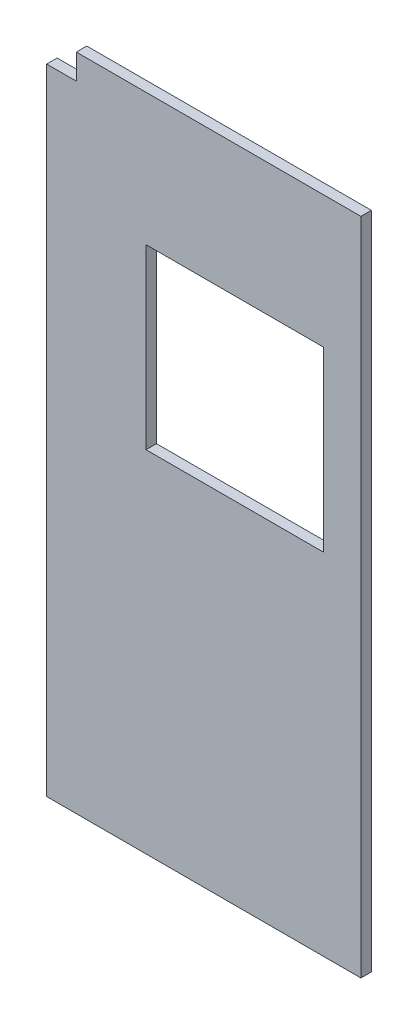
ISO-10303-21;
HEADER;
FILE_DESCRIPTION(('STEP AP214'),'2;1');
FILE_NAME('part.step','',(''),(''),'','','');
FILE_SCHEMA(('AUTOMOTIVE_DESIGN { 1 0 10303 214 1 1 1 1 }'));
ENDSEC;
DATA;
#1=APPLICATION_CONTEXT('core data for automotive mechanical design processes');
#2=APPLICATION_PROTOCOL_DEFINITION('international standard','automotive_design',2000,#1);
#3=PRODUCT_CONTEXT('',#1,'mechanical');
#4=PRODUCT('Part','Part','',(#3));
#5=PRODUCT_RELATED_PRODUCT_CATEGORY('part','',(#4));
#6=PRODUCT_DEFINITION_FORMATION('','',#4);
#7=PRODUCT_DEFINITION_CONTEXT('part definition',#1,'design');
#8=PRODUCT_DEFINITION('design','',#6,#7);
#9=PRODUCT_DEFINITION_SHAPE('','',#8);
#10=(LENGTH_UNIT() NAMED_UNIT(*) SI_UNIT(.MILLI.,.METRE.));
#11=(NAMED_UNIT(*) PLANE_ANGLE_UNIT() SI_UNIT($,.RADIAN.));
#12=(NAMED_UNIT(*) SI_UNIT($,.STERADIAN.) SOLID_ANGLE_UNIT());
#13=UNCERTAINTY_MEASURE_WITH_UNIT(LENGTH_MEASURE(1.E-05),#10,'distance_accuracy_value','');
#14=(GEOMETRIC_REPRESENTATION_CONTEXT(3) GLOBAL_UNCERTAINTY_ASSIGNED_CONTEXT((#13)) GLOBAL_UNIT_ASSIGNED_CONTEXT((#10,
#11,#12)) REPRESENTATION_CONTEXT('',''));
#15=CARTESIAN_POINT('',(0.,0.,0.));
#16=DIRECTION('',(0.,0.,1.));
#17=DIRECTION('',(1.,0.,0.));
#18=AXIS2_PLACEMENT_3D('',#15,#16,#17);
#19=CARTESIAN_POINT('',(0.,0.,38.1));
#20=DIRECTION('',(0.,0.,1.));
#21=DIRECTION('',(1.,0.,0.));
#22=AXIS2_PLACEMENT_3D('',#19,#20,#21);
#23=PLANE('',#22);
#24=DIRECTION('',(0.,1.,0.));
#25=VECTOR('',#24,1.);
#26=CARTESIAN_POINT('',(-464.947,1202.944,38.1));
#27=LINE('',#26,#25);
#28=CARTESIAN_POINT('',(-464.947,1110.996,38.1));
#29=VERTEX_POINT('',#28);
#30=CARTESIAN_POINT('',(-464.947,1202.944,38.1));
#31=VERTEX_POINT('',#30);
#32=EDGE_CURVE('E110',#29,#31,#27,.T.);
#33=ORIENTED_EDGE('',*,*,#32,.F.);
#34=DIRECTION('',(1.,0.,0.));
#35=VECTOR('',#34,1.);
#36=CARTESIAN_POINT('',(-573.151,1110.996,38.1));
#37=LINE('',#36,#35);
#38=CARTESIAN_POINT('',(-573.151,1110.996,38.1));
#39=VERTEX_POINT('',#38);
#40=EDGE_CURVE('E120',#39,#29,#37,.T.);
#41=ORIENTED_EDGE('',*,*,#40,.F.);
#42=DIRECTION('',(0.,-1.,0.));
#43=VECTOR('',#42,1.);
#44=CARTESIAN_POINT('',(-573.151,1202.944,38.1));
#45=LINE('',#44,#43);
#46=CARTESIAN_POINT('',(-573.151,-1202.944,38.1));
#47=VERTEX_POINT('',#46);
#48=EDGE_CURVE('E134',#39,#47,#45,.T.);
#49=ORIENTED_EDGE('',*,*,#48,.T.);
#50=DIRECTION('',(1.,0.,0.));
#51=VECTOR('',#50,1.);
#52=CARTESIAN_POINT('',(-573.151,-1202.944,38.1));
#53=LINE('',#52,#51);
#54=CARTESIAN_POINT('',(573.151,-1202.944,38.1));
#55=VERTEX_POINT('',#54);
#56=EDGE_CURVE('E136',#47,#55,#53,.T.);
#57=ORIENTED_EDGE('',*,*,#56,.T.);
#58=DIRECTION('',(0.,1.,0.));
#59=VECTOR('',#58,1.);
#60=CARTESIAN_POINT('',(573.151,1202.944,38.1));
#61=LINE('',#60,#59);
#62=CARTESIAN_POINT('',(573.151,1202.944,38.1));
#63=VERTEX_POINT('',#62);
#64=EDGE_CURVE('E132',#55,#63,#61,.T.);
#65=ORIENTED_EDGE('',*,*,#64,.T.);
#66=DIRECTION('',(-1.,0.,0.));
#67=VECTOR('',#66,1.);
#68=CARTESIAN_POINT('',(-573.151,1202.944,38.1));
#69=LINE('',#68,#67);
#70=EDGE_CURVE('E125',#63,#31,#69,.T.);
#71=ORIENTED_EDGE('',*,*,#70,.T.);
#72=EDGE_LOOP('',(#33,#41,#49,#57,#65,#71));
#73=FACE_BOUND('',#72,.T.);
#74=DIRECTION('',(-1.,0.,0.));
#75=VECTOR('',#74,1.);
#76=CARTESIAN_POINT('',(-210.693,721.614,38.1));
#77=LINE('',#76,#75);
#78=CARTESIAN_POINT('',(437.007,721.614,38.1));
#79=VERTEX_POINT('',#78);
#80=CARTESIAN_POINT('',(-210.693,721.614,38.1));
#81=VERTEX_POINT('',#80);
#82=EDGE_CURVE('E195',#79,#81,#77,.T.);
#83=ORIENTED_EDGE('',*,*,#82,.F.);
#84=DIRECTION('',(0.,1.,0.));
#85=VECTOR('',#84,1.);
#86=CARTESIAN_POINT('',(437.007,721.614,38.1));
#87=LINE('',#86,#85);
#88=CARTESIAN_POINT('',(437.007,73.914,38.1));
#89=VERTEX_POINT('',#88);
#90=EDGE_CURVE('E193',#89,#79,#87,.T.);
#91=ORIENTED_EDGE('',*,*,#90,.F.);
#92=DIRECTION('',(1.,0.,0.));
#93=VECTOR('',#92,1.);
#94=CARTESIAN_POINT('',(-210.693,73.914,38.1));
#95=LINE('',#94,#93);
#96=CARTESIAN_POINT('',(-210.693,73.914,38.1));
#97=VERTEX_POINT('',#96);
#98=EDGE_CURVE('E200',#97,#89,#95,.T.);
#99=ORIENTED_EDGE('',*,*,#98,.F.);
#100=DIRECTION('',(0.,-1.,0.));
#101=VECTOR('',#100,1.);
#102=CARTESIAN_POINT('',(-210.693,721.614,38.1));
#103=LINE('',#102,#101);
#104=EDGE_CURVE('E198',#81,#97,#103,.T.);
#105=ORIENTED_EDGE('',*,*,#104,.F.);
#106=EDGE_LOOP('',(#83,#91,#99,#105));
#107=FACE_BOUND('',#106,.T.);
#108=ADVANCED_FACE('F33',(#73,#107),#23,.T.);
#109=CARTESIAN_POINT('',(0.,0.,0.));
#110=DIRECTION('',(0.,0.,1.));
#111=DIRECTION('',(1.,0.,0.));
#112=AXIS2_PLACEMENT_3D('',#109,#110,#111);
#113=PLANE('',#112);
#114=DIRECTION('',(-1.,0.,0.));
#115=VECTOR('',#114,1.);
#116=CARTESIAN_POINT('',(-573.151,1110.996,0.));
#117=LINE('',#116,#115);
#118=CARTESIAN_POINT('',(-464.947,1110.996,0.));
#119=VERTEX_POINT('',#118);
#120=CARTESIAN_POINT('',(-573.151,1110.996,0.));
#121=VERTEX_POINT('',#120);
#122=EDGE_CURVE('E48',#119,#121,#117,.T.);
#123=ORIENTED_EDGE('',*,*,#122,.F.);
#124=DIRECTION('',(0.,-1.,0.));
#125=VECTOR('',#124,1.);
#126=CARTESIAN_POINT('',(-464.947,1202.944,0.));
#127=LINE('',#126,#125);
#128=CARTESIAN_POINT('',(-464.947,1202.944,0.));
#129=VERTEX_POINT('',#128);
#130=EDGE_CURVE('E207',#129,#119,#127,.T.);
#131=ORIENTED_EDGE('',*,*,#130,.F.);
#132=DIRECTION('',(-1.,0.,0.));
#133=VECTOR('',#132,1.);
#134=CARTESIAN_POINT('',(-573.151,1202.944,0.));
#135=LINE('',#134,#133);
#136=CARTESIAN_POINT('',(573.151,1202.944,0.));
#137=VERTEX_POINT('',#136);
#138=EDGE_CURVE('E127',#137,#129,#135,.T.);
#139=ORIENTED_EDGE('',*,*,#138,.F.);
#140=DIRECTION('',(0.,1.,0.));
#141=VECTOR('',#140,1.);
#142=CARTESIAN_POINT('',(573.151,1202.944,0.));
#143=LINE('',#142,#141);
#144=CARTESIAN_POINT('',(573.151,-1202.944,0.));
#145=VERTEX_POINT('',#144);
#146=EDGE_CURVE('E144',#145,#137,#143,.T.);
#147=ORIENTED_EDGE('',*,*,#146,.F.);
#148=DIRECTION('',(1.,0.,0.));
#149=VECTOR('',#148,1.);
#150=CARTESIAN_POINT('',(-573.151,-1202.944,0.));
#151=LINE('',#150,#149);
#152=CARTESIAN_POINT('',(-573.151,-1202.944,0.));
#153=VERTEX_POINT('',#152);
#154=EDGE_CURVE('E138',#153,#145,#151,.T.);
#155=ORIENTED_EDGE('',*,*,#154,.F.);
#156=DIRECTION('',(0.,-1.,0.));
#157=VECTOR('',#156,1.);
#158=CARTESIAN_POINT('',(-573.151,1202.944,0.));
#159=LINE('',#158,#157);
#160=EDGE_CURVE('E149',#121,#153,#159,.T.);
#161=ORIENTED_EDGE('',*,*,#160,.F.);
#162=EDGE_LOOP('',(#123,#131,#139,#147,#155,#161));
#163=FACE_BOUND('',#162,.T.);
#164=DIRECTION('',(0.,1.,0.));
#165=VECTOR('',#164,1.);
#166=CARTESIAN_POINT('',(437.007,721.614,0.));
#167=LINE('',#166,#165);
#168=CARTESIAN_POINT('',(437.007,73.914,0.));
#169=VERTEX_POINT('',#168);
#170=CARTESIAN_POINT('',(437.007,721.614,0.));
#171=VERTEX_POINT('',#170);
#172=EDGE_CURVE('E203',#169,#171,#167,.T.);
#173=ORIENTED_EDGE('',*,*,#172,.T.);
#174=DIRECTION('',(-1.,0.,0.));
#175=VECTOR('',#174,1.);
#176=CARTESIAN_POINT('',(-210.693,721.614,0.));
#177=LINE('',#176,#175);
#178=CARTESIAN_POINT('',(-210.693,721.614,0.));
#179=VERTEX_POINT('',#178);
#180=EDGE_CURVE('E206',#171,#179,#177,.T.);
#181=ORIENTED_EDGE('',*,*,#180,.T.);
#182=DIRECTION('',(0.,-1.,0.));
#183=VECTOR('',#182,1.);
#184=CARTESIAN_POINT('',(-210.693,721.614,0.));
#185=LINE('',#184,#183);
#186=CARTESIAN_POINT('',(-210.693,73.914,0.));
#187=VERTEX_POINT('',#186);
#188=EDGE_CURVE('E210',#179,#187,#185,.T.);
#189=ORIENTED_EDGE('',*,*,#188,.T.);
#190=DIRECTION('',(1.,0.,0.));
#191=VECTOR('',#190,1.);
#192=CARTESIAN_POINT('',(-210.693,73.914,0.));
#193=LINE('',#192,#191);
#194=EDGE_CURVE('E196',#187,#169,#193,.T.);
#195=ORIENTED_EDGE('',*,*,#194,.T.);
#196=EDGE_LOOP('',(#173,#181,#189,#195));
#197=FACE_BOUND('',#196,.T.);
#198=ADVANCED_FACE('F165',(#163,#197),#113,.F.);
#199=CARTESIAN_POINT('',(573.151,1202.944,38.1));
#200=DIRECTION('',(-1.,0.,0.));
#201=DIRECTION('',(0.,-1.,0.));
#202=AXIS2_PLACEMENT_3D('',#199,#200,#201);
#203=PLANE('',#202);
#204=ORIENTED_EDGE('',*,*,#146,.T.);
#205=DIRECTION('',(0.,0.,-1.));
#206=VECTOR('',#205,1.);
#207=CARTESIAN_POINT('',(573.151,1202.944,38.1));
#208=LINE('',#207,#206);
#209=EDGE_CURVE('E11',#63,#137,#208,.T.);
#210=ORIENTED_EDGE('',*,*,#209,.F.);
#211=ORIENTED_EDGE('',*,*,#64,.F.);
#212=DIRECTION('',(0.,0.,-1.));
#213=VECTOR('',#212,1.);
#214=CARTESIAN_POINT('',(573.151,-1202.944,38.1));
#215=LINE('',#214,#213);
#216=EDGE_CURVE('E143',#55,#145,#215,.T.);
#217=ORIENTED_EDGE('',*,*,#216,.T.);
#218=EDGE_LOOP('',(#204,#210,#211,#217));
#219=FACE_BOUND('',#218,.T.);
#220=ADVANCED_FACE('F35',(#219),#203,.F.);
#221=CARTESIAN_POINT('',(-573.151,1202.944,38.1));
#222=DIRECTION('',(0.,-1.,0.));
#223=DIRECTION('',(0.,0.,-1.));
#224=AXIS2_PLACEMENT_3D('',#221,#222,#223);
#225=PLANE('',#224);
#226=ORIENTED_EDGE('',*,*,#138,.T.);
#227=DIRECTION('',(0.,0.,1.));
#228=VECTOR('',#227,1.);
#229=CARTESIAN_POINT('',(-464.947,1202.944,-141.99486018867));
#230=LINE('',#229,#228);
#231=EDGE_CURVE('E113',#129,#31,#230,.T.);
#232=ORIENTED_EDGE('',*,*,#231,.T.);
#233=ORIENTED_EDGE('',*,*,#70,.F.);
#234=ORIENTED_EDGE('',*,*,#209,.T.);
#235=EDGE_LOOP('',(#226,#232,#233,#234));
#236=FACE_BOUND('',#235,.T.);
#237=ADVANCED_FACE('F124',(#236),#225,.F.);
#238=CARTESIAN_POINT('',(-573.151,1202.944,38.1));
#239=DIRECTION('',(1.,0.,0.));
#240=DIRECTION('',(0.,1.,0.));
#241=AXIS2_PLACEMENT_3D('',#238,#239,#240);
#242=PLANE('',#241);
#243=ORIENTED_EDGE('',*,*,#48,.F.);
#244=DIRECTION('',(0.,0.,1.));
#245=VECTOR('',#244,1.);
#246=CARTESIAN_POINT('',(-573.151,1110.996,-141.99486018867));
#247=LINE('',#246,#245);
#248=EDGE_CURVE('E128',#121,#39,#247,.T.);
#249=ORIENTED_EDGE('',*,*,#248,.F.);
#250=ORIENTED_EDGE('',*,*,#160,.T.);
#251=DIRECTION('',(0.,0.,-1.));
#252=VECTOR('',#251,1.);
#253=CARTESIAN_POINT('',(-573.151,-1202.944,38.1));
#254=LINE('',#253,#252);
#255=EDGE_CURVE('E41',#47,#153,#254,.T.);
#256=ORIENTED_EDGE('',*,*,#255,.F.);
#257=EDGE_LOOP('',(#243,#249,#250,#256));
#258=FACE_BOUND('',#257,.T.);
#259=ADVANCED_FACE('F173',(#258),#242,.F.);
#260=CARTESIAN_POINT('',(-573.151,-1202.944,38.1));
#261=DIRECTION('',(0.,1.,0.));
#262=DIRECTION('',(0.,0.,1.));
#263=AXIS2_PLACEMENT_3D('',#260,#261,#262);
#264=PLANE('',#263);
#265=ORIENTED_EDGE('',*,*,#154,.T.);
#266=ORIENTED_EDGE('',*,*,#216,.F.);
#267=ORIENTED_EDGE('',*,*,#56,.F.);
#268=ORIENTED_EDGE('',*,*,#255,.T.);
#269=EDGE_LOOP('',(#265,#266,#267,#268));
#270=FACE_BOUND('',#269,.T.);
#271=ADVANCED_FACE('F158',(#270),#264,.F.);
#272=CARTESIAN_POINT('',(437.007,721.614,38.1));
#273=DIRECTION('',(-1.,0.,0.));
#274=DIRECTION('',(0.,-1.,0.));
#275=AXIS2_PLACEMENT_3D('',#272,#273,#274);
#276=PLANE('',#275);
#277=ORIENTED_EDGE('',*,*,#172,.F.);
#278=DIRECTION('',(0.,0.,-1.));
#279=VECTOR('',#278,1.);
#280=CARTESIAN_POINT('',(437.007,73.914,38.1));
#281=LINE('',#280,#279);
#282=EDGE_CURVE('E202',#89,#169,#281,.T.);
#283=ORIENTED_EDGE('',*,*,#282,.F.);
#284=ORIENTED_EDGE('',*,*,#90,.T.);
#285=DIRECTION('',(0.,0.,-1.));
#286=VECTOR('',#285,1.);
#287=CARTESIAN_POINT('',(437.007,721.614,38.1));
#288=LINE('',#287,#286);
#289=EDGE_CURVE('E147',#79,#171,#288,.T.);
#290=ORIENTED_EDGE('',*,*,#289,.T.);
#291=EDGE_LOOP('',(#277,#283,#284,#290));
#292=FACE_BOUND('',#291,.T.);
#293=ADVANCED_FACE('F180',(#292),#276,.T.);
#294=CARTESIAN_POINT('',(-210.693,721.614,38.1));
#295=DIRECTION('',(0.,-1.,0.));
#296=DIRECTION('',(0.,0.,-1.));
#297=AXIS2_PLACEMENT_3D('',#294,#295,#296);
#298=PLANE('',#297);
#299=ORIENTED_EDGE('',*,*,#180,.F.);
#300=ORIENTED_EDGE('',*,*,#289,.F.);
#301=ORIENTED_EDGE('',*,*,#82,.T.);
#302=DIRECTION('',(0.,0.,-1.));
#303=VECTOR('',#302,1.);
#304=CARTESIAN_POINT('',(-210.693,721.614,38.1));
#305=LINE('',#304,#303);
#306=EDGE_CURVE('E218',#81,#179,#305,.T.);
#307=ORIENTED_EDGE('',*,*,#306,.T.);
#308=EDGE_LOOP('',(#299,#300,#301,#307));
#309=FACE_BOUND('',#308,.T.);
#310=ADVANCED_FACE('F231',(#309),#298,.T.);
#311=CARTESIAN_POINT('',(-210.693,721.614,38.1));
#312=DIRECTION('',(1.,0.,0.));
#313=DIRECTION('',(0.,1.,0.));
#314=AXIS2_PLACEMENT_3D('',#311,#312,#313);
#315=PLANE('',#314);
#316=ORIENTED_EDGE('',*,*,#188,.F.);
#317=ORIENTED_EDGE('',*,*,#306,.F.);
#318=ORIENTED_EDGE('',*,*,#104,.T.);
#319=DIRECTION('',(0.,0.,-1.));
#320=VECTOR('',#319,1.);
#321=CARTESIAN_POINT('',(-210.693,73.914,38.1));
#322=LINE('',#321,#320);
#323=EDGE_CURVE('E56',#97,#187,#322,.T.);
#324=ORIENTED_EDGE('',*,*,#323,.T.);
#325=EDGE_LOOP('',(#316,#317,#318,#324));
#326=FACE_BOUND('',#325,.T.);
#327=ADVANCED_FACE('F233',(#326),#315,.T.);
#328=CARTESIAN_POINT('',(-210.693,73.914,38.1));
#329=DIRECTION('',(0.,1.,0.));
#330=DIRECTION('',(0.,0.,1.));
#331=AXIS2_PLACEMENT_3D('',#328,#329,#330);
#332=PLANE('',#331);
#333=ORIENTED_EDGE('',*,*,#194,.F.);
#334=ORIENTED_EDGE('',*,*,#323,.F.);
#335=ORIENTED_EDGE('',*,*,#98,.T.);
#336=ORIENTED_EDGE('',*,*,#282,.T.);
#337=EDGE_LOOP('',(#333,#334,#335,#336));
#338=FACE_BOUND('',#337,.T.);
#339=ADVANCED_FACE('F227',(#338),#332,.T.);
#340=CARTESIAN_POINT('',(-464.947,1202.944,-141.99486018867));
#341=DIRECTION('',(1.,0.,0.));
#342=DIRECTION('',(0.,1.,0.));
#343=AXIS2_PLACEMENT_3D('',#340,#341,#342);
#344=PLANE('',#343);
#345=ORIENTED_EDGE('',*,*,#130,.T.);
#346=DIRECTION('',(0.,0.,1.));
#347=VECTOR('',#346,1.);
#348=CARTESIAN_POINT('',(-464.947,1110.996,-141.99486018867));
#349=LINE('',#348,#347);
#350=EDGE_CURVE('E115',#119,#29,#349,.T.);
#351=ORIENTED_EDGE('',*,*,#350,.T.);
#352=ORIENTED_EDGE('',*,*,#32,.T.);
#353=ORIENTED_EDGE('',*,*,#231,.F.);
#354=EDGE_LOOP('',(#345,#351,#352,#353));
#355=FACE_BOUND('',#354,.T.);
#356=ADVANCED_FACE('F112',(#355),#344,.F.);
#357=CARTESIAN_POINT('',(-573.151,1110.996,-141.99486018867));
#358=DIRECTION('',(0.,-1.,0.));
#359=DIRECTION('',(0.,0.,-1.));
#360=AXIS2_PLACEMENT_3D('',#357,#358,#359);
#361=PLANE('',#360);
#362=ORIENTED_EDGE('',*,*,#122,.T.);
#363=ORIENTED_EDGE('',*,*,#248,.T.);
#364=ORIENTED_EDGE('',*,*,#40,.T.);
#365=ORIENTED_EDGE('',*,*,#350,.F.);
#366=EDGE_LOOP('',(#362,#363,#364,#365));
#367=FACE_BOUND('',#366,.T.);
#368=ADVANCED_FACE('F244',(#367),#361,.F.);
#369=CLOSED_SHELL('',(#108,#198,#220,#237,#259,#271,#293,#310,#327,#339,#356,#368));
#370=MANIFOLD_SOLID_BREP('B2',#369);
#371=ADVANCED_BREP_SHAPE_REPRESENTATION('',(#18,#370),#14);
#372=SHAPE_DEFINITION_REPRESENTATION(#9,#371);
ENDSEC;
END-ISO-10303-21;
